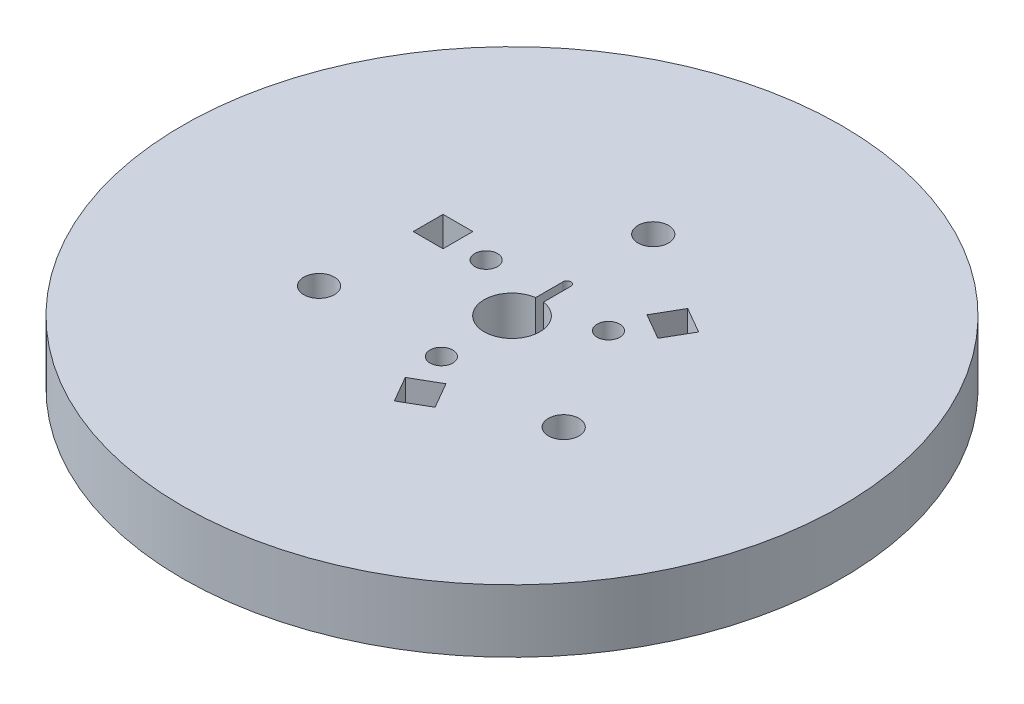
ISO-10303-21;
HEADER;
FILE_DESCRIPTION(('STEP AP214'),'2;1');
FILE_NAME('part.step','',(''),(''),'','','');
FILE_SCHEMA(('AUTOMOTIVE_DESIGN { 1 0 10303 214 1 1 1 1 }'));
ENDSEC;
DATA;
#1=APPLICATION_CONTEXT('core data for automotive mechanical design processes');
#2=APPLICATION_PROTOCOL_DEFINITION('international standard','automotive_design',2000,#1);
#3=PRODUCT_CONTEXT('',#1,'mechanical');
#4=PRODUCT('Part','Part','',(#3));
#5=PRODUCT_RELATED_PRODUCT_CATEGORY('part','',(#4));
#6=PRODUCT_DEFINITION_FORMATION('','',#4);
#7=PRODUCT_DEFINITION_CONTEXT('part definition',#1,'design');
#8=PRODUCT_DEFINITION('design','',#6,#7);
#9=PRODUCT_DEFINITION_SHAPE('','',#8);
#10=(LENGTH_UNIT() NAMED_UNIT(*) SI_UNIT(.MILLI.,.METRE.));
#11=(NAMED_UNIT(*) PLANE_ANGLE_UNIT() SI_UNIT($,.RADIAN.));
#12=(NAMED_UNIT(*) SI_UNIT($,.STERADIAN.) SOLID_ANGLE_UNIT());
#13=UNCERTAINTY_MEASURE_WITH_UNIT(LENGTH_MEASURE(1.E-05),#10,'distance_accuracy_value','');
#14=(GEOMETRIC_REPRESENTATION_CONTEXT(3) GLOBAL_UNCERTAINTY_ASSIGNED_CONTEXT((#13)) GLOBAL_UNIT_ASSIGNED_CONTEXT((#10,
#11,#12)) REPRESENTATION_CONTEXT('',''));
#15=CARTESIAN_POINT('',(0.,0.,0.));
#16=DIRECTION('',(0.,0.,1.));
#17=DIRECTION('',(1.,0.,0.));
#18=AXIS2_PLACEMENT_3D('',#15,#16,#17);
#19=CARTESIAN_POINT('',(0.,8.,0.));
#20=DIRECTION('',(0.,1.,0.));
#21=DIRECTION('',(0.,0.,1.));
#22=AXIS2_PLACEMENT_3D('',#19,#20,#21);
#23=PLANE('',#22);
#24=DIRECTION('',(0.500000000000008,0.,0.866025403784434));
#25=VECTOR('',#24,1.);
#26=CARTESIAN_POINT('',(1.90525588832576,8.,16.9));
#27=LINE('',#26,#25);
#28=CARTESIAN_POINT('',(0.00525588832573222,8.,13.6091034656191));
#29=VERTEX_POINT('',#28);
#30=CARTESIAN_POINT('',(1.90525588832576,8.,16.9));
#31=VERTEX_POINT('',#30);
#32=EDGE_CURVE('E50',#29,#31,#27,.T.);
#33=ORIENTED_EDGE('',*,*,#32,.F.);
#34=DIRECTION('',(-0.866025403784436,0.,0.500000000000004));
#35=VECTOR('',#34,1.);
#36=CARTESIAN_POINT('',(0.00525588832573222,8.,13.6091034656191));
#37=LINE('',#36,#35);
#38=CARTESIAN_POINT('',(3.29615242270659,8.,11.7091034656191));
#39=VERTEX_POINT('',#38);
#40=EDGE_CURVE('E194',#39,#29,#37,.T.);
#41=ORIENTED_EDGE('',*,*,#40,.F.);
#42=DIRECTION('',(-0.500000000000008,0.,-0.866025403784434));
#43=VECTOR('',#42,1.);
#44=CARTESIAN_POINT('',(5.19615242270662,8.,15.));
#45=LINE('',#44,#43);
#46=CARTESIAN_POINT('',(5.19615242270662,8.,15.));
#47=VERTEX_POINT('',#46);
#48=EDGE_CURVE('E191',#47,#39,#45,.T.);
#49=ORIENTED_EDGE('',*,*,#48,.F.);
#50=DIRECTION('',(0.866025403784436,0.,-0.500000000000005));
#51=VECTOR('',#50,1.);
#52=CARTESIAN_POINT('',(1.90525588832576,8.,16.9));
#53=LINE('',#52,#51);
#54=EDGE_CURVE('E187',#31,#47,#53,.T.);
#55=ORIENTED_EDGE('',*,*,#54,.F.);
#56=EDGE_LOOP('',(#33,#41,#49,#55));
#57=FACE_BOUND('',#56,.T.);
#58=DIRECTION('',(-1.,0.,0.));
#59=VECTOR('',#58,1.);
#60=CARTESIAN_POINT('',(-15.5884572681199,8.,-6.80000000000006));
#61=LINE('',#60,#59);
#62=CARTESIAN_POINT('',(-11.7884572681199,8.,-6.80000000000008));
#63=VERTEX_POINT('',#62);
#64=CARTESIAN_POINT('',(-15.5884572681199,8.,-6.80000000000006));
#65=VERTEX_POINT('',#64);
#66=EDGE_CURVE('E58',#63,#65,#61,.T.);
#67=ORIENTED_EDGE('',*,*,#66,.F.);
#68=DIRECTION('',(0.,0.,-1.));
#69=VECTOR('',#68,1.);
#70=CARTESIAN_POINT('',(-11.7884572681199,8.,-6.80000000000008));
#71=LINE('',#70,#69);
#72=CARTESIAN_POINT('',(-11.7884572681199,8.,-3.00000000000008));
#73=VERTEX_POINT('',#72);
#74=EDGE_CURVE('E214',#73,#63,#71,.T.);
#75=ORIENTED_EDGE('',*,*,#74,.F.);
#76=DIRECTION('',(1.,0.,0.));
#77=VECTOR('',#76,1.);
#78=CARTESIAN_POINT('',(-15.5884572681199,8.,-3.00000000000006));
#79=LINE('',#78,#77);
#80=CARTESIAN_POINT('',(-15.5884572681199,8.,-3.00000000000006));
#81=VERTEX_POINT('',#80);
#82=EDGE_CURVE('E211',#81,#73,#79,.T.);
#83=ORIENTED_EDGE('',*,*,#82,.F.);
#84=DIRECTION('',(0.,0.,1.));
#85=VECTOR('',#84,1.);
#86=CARTESIAN_POINT('',(-15.5884572681199,8.,-6.80000000000006));
#87=LINE('',#86,#85);
#88=EDGE_CURVE('E207',#65,#81,#87,.T.);
#89=ORIENTED_EDGE('',*,*,#88,.F.);
#90=EDGE_LOOP('',(#67,#75,#83,#89));
#91=FACE_BOUND('',#90,.T.);
#92=DIRECTION('',(0.5,0.,-0.866025403784439));
#93=VECTOR('',#92,1.);
#94=CARTESIAN_POINT('',(13.6832013797942,8.,-10.0999999999999));
#95=LINE('',#94,#93);
#96=CARTESIAN_POINT('',(11.7832013797942,8.,-6.80910346561901));
#97=VERTEX_POINT('',#96);
#98=CARTESIAN_POINT('',(13.6832013797942,8.,-10.0999999999999));
#99=VERTEX_POINT('',#98);
#100=EDGE_CURVE('E184',#97,#99,#95,.T.);
#101=ORIENTED_EDGE('',*,*,#100,.F.);
#102=DIRECTION('',(0.866025403784437,0.,0.500000000000003));
#103=VECTOR('',#102,1.);
#104=CARTESIAN_POINT('',(11.7832013797942,8.,-6.80910346561901));
#105=LINE('',#104,#103);
#106=CARTESIAN_POINT('',(8.49230484541335,8.,-8.70910346561902));
#107=VERTEX_POINT('',#106);
#108=EDGE_CURVE('E231',#107,#97,#105,.T.);
#109=ORIENTED_EDGE('',*,*,#108,.F.);
#110=DIRECTION('',(-0.5,0.,0.866025403784439));
#111=VECTOR('',#110,1.);
#112=CARTESIAN_POINT('',(10.3923048454134,8.,-11.9999999999999));
#113=LINE('',#112,#111);
#114=CARTESIAN_POINT('',(10.3923048454134,8.,-11.9999999999999));
#115=VERTEX_POINT('',#114);
#116=EDGE_CURVE('E228',#115,#107,#113,.T.);
#117=ORIENTED_EDGE('',*,*,#116,.F.);
#118=DIRECTION('',(-0.866025403784436,0.,-0.500000000000004));
#119=VECTOR('',#118,1.);
#120=CARTESIAN_POINT('',(13.6832013797942,8.,-10.0999999999999));
#121=LINE('',#120,#119);
#122=EDGE_CURVE('E225',#99,#115,#121,.T.);
#123=ORIENTED_EDGE('',*,*,#122,.F.);
#124=EDGE_LOOP('',(#101,#109,#117,#123));
#125=FACE_BOUND('',#124,.T.);
#126=DIRECTION('',(0.,0.,-1.));
#127=VECTOR('',#126,1.);
#128=CARTESIAN_POINT('',(0.499999999999999,8.,-7.));
#129=LINE('',#128,#127);
#130=CARTESIAN_POINT('',(0.499999999999999,8.,-3.51461235415799));
#131=VERTEX_POINT('',#130);
#132=CARTESIAN_POINT('',(0.499999999999999,8.,-7.));
#133=VERTEX_POINT('',#132);
#134=EDGE_CURVE('E157',#131,#133,#129,.T.);
#135=ORIENTED_EDGE('',*,*,#134,.F.);
#136=CARTESIAN_POINT('',(0.,8.,0.));
#137=DIRECTION('',(0.,1.,0.));
#138=DIRECTION('',(0.,0.,1.));
#139=AXIS2_PLACEMENT_3D('',#136,#137,#138);
#140=CIRCLE('',#139,3.55);
#141=CARTESIAN_POINT('',(-0.499999999999998,8.,-3.51461235415799));
#142=VERTEX_POINT('',#141);
#143=EDGE_CURVE('E262',#142,#131,#140,.T.);
#144=ORIENTED_EDGE('',*,*,#143,.F.);
#145=DIRECTION('',(0.,0.,1.));
#146=VECTOR('',#145,1.);
#147=CARTESIAN_POINT('',(-0.499999999999999,8.,-7.));
#148=LINE('',#147,#146);
#149=CARTESIAN_POINT('',(-0.499999999999999,8.,-7.));
#150=VERTEX_POINT('',#149);
#151=EDGE_CURVE('E243',#150,#142,#148,.T.);
#152=ORIENTED_EDGE('',*,*,#151,.F.);
#153=CARTESIAN_POINT('',(0.,8.,-7.));
#154=DIRECTION('',(0.,1.,0.));
#155=DIRECTION('',(0.,0.,1.));
#156=AXIS2_PLACEMENT_3D('',#153,#154,#155);
#157=CIRCLE('',#156,0.499999999999999);
#158=EDGE_CURVE('E200',#133,#150,#157,.T.);
#159=ORIENTED_EDGE('',*,*,#158,.F.);
#160=EDGE_LOOP('',(#135,#144,#152,#159));
#161=FACE_BOUND('',#160,.T.);
#162=CARTESIAN_POINT('',(0.,8.,9.));
#163=DIRECTION('',(0.,1.,0.));
#164=DIRECTION('',(0.,0.,1.));
#165=AXIS2_PLACEMENT_3D('',#162,#163,#164);
#166=CIRCLE('',#165,1.45);
#167=CARTESIAN_POINT('',(0.,8.,10.45));
#168=VERTEX_POINT('',#167);
#169=EDGE_CURVE('E249',#168,#168,#166,.T.);
#170=ORIENTED_EDGE('',*,*,#169,.F.);
#171=EDGE_LOOP('',(#170));
#172=FACE_BOUND('',#171,.T.);
#173=CARTESIAN_POINT('',(15.5884572681197,8.,9.00000000000029));
#174=DIRECTION('',(0.,1.,0.));
#175=DIRECTION('',(0.,0.,1.));
#176=AXIS2_PLACEMENT_3D('',#173,#174,#175);
#177=CIRCLE('',#176,1.95);
#178=CARTESIAN_POINT('',(15.5884572681197,8.,10.9500000000003));
#179=VERTEX_POINT('',#178);
#180=EDGE_CURVE('E259',#179,#179,#177,.T.);
#181=ORIENTED_EDGE('',*,*,#180,.F.);
#182=EDGE_LOOP('',(#181));
#183=FACE_BOUND('',#182,.T.);
#184=CARTESIAN_POINT('',(7.79422863405996,8.,-4.49999999999998));
#185=DIRECTION('',(0.,1.,0.));
#186=DIRECTION('',(0.,0.,1.));
#187=AXIS2_PLACEMENT_3D('',#184,#185,#186);
#188=CIRCLE('',#187,1.45);
#189=CARTESIAN_POINT('',(7.79422863405996,8.,-3.04999999999998));
#190=VERTEX_POINT('',#189);
#191=EDGE_CURVE('E267',#190,#190,#188,.T.);
#192=ORIENTED_EDGE('',*,*,#191,.F.);
#193=EDGE_LOOP('',(#192));
#194=FACE_BOUND('',#193,.T.);
#195=CARTESIAN_POINT('',(0.,8.,0.));
#196=DIRECTION('',(0.,1.,0.));
#197=DIRECTION('',(0.,0.,1.));
#198=AXIS2_PLACEMENT_3D('',#195,#196,#197);
#199=CIRCLE('',#198,42.);
#200=CARTESIAN_POINT('',(0.,8.,42.));
#201=VERTEX_POINT('',#200);
#202=EDGE_CURVE('E277',#201,#201,#199,.T.);
#203=ORIENTED_EDGE('',*,*,#202,.T.);
#204=EDGE_LOOP('',(#203));
#205=FACE_BOUND('',#204,.T.);
#206=CARTESIAN_POINT('',(0.,8.,-18.));
#207=DIRECTION('',(0.,1.,0.));
#208=DIRECTION('',(0.,0.,1.));
#209=AXIS2_PLACEMENT_3D('',#206,#207,#208);
#210=CIRCLE('',#209,1.95);
#211=CARTESIAN_POINT('',(0.,8.,-16.05));
#212=VERTEX_POINT('',#211);
#213=EDGE_CURVE('E271',#212,#212,#210,.T.);
#214=ORIENTED_EDGE('',*,*,#213,.F.);
#215=EDGE_LOOP('',(#214));
#216=FACE_BOUND('',#215,.T.);
#217=CARTESIAN_POINT('',(-15.5884572681201,8.,8.99999999999964));
#218=DIRECTION('',(0.,1.,0.));
#219=DIRECTION('',(0.,0.,1.));
#220=AXIS2_PLACEMENT_3D('',#217,#218,#219);
#221=CIRCLE('',#220,1.95);
#222=CARTESIAN_POINT('',(-15.5884572681201,8.,10.9499999999996));
#223=VERTEX_POINT('',#222);
#224=EDGE_CURVE('E253',#223,#223,#221,.T.);
#225=ORIENTED_EDGE('',*,*,#224,.F.);
#226=EDGE_LOOP('',(#225));
#227=FACE_BOUND('',#226,.T.);
#228=CARTESIAN_POINT('',(-7.79422863405989,8.,-4.50000000000009));
#229=DIRECTION('',(0.,1.,0.));
#230=DIRECTION('',(0.,0.,1.));
#231=AXIS2_PLACEMENT_3D('',#228,#229,#230);
#232=CIRCLE('',#231,1.45);
#233=CARTESIAN_POINT('',(-7.79422863405989,8.,-3.05000000000009));
#234=VERTEX_POINT('',#233);
#235=EDGE_CURVE('E161',#234,#234,#232,.T.);
#236=ORIENTED_EDGE('',*,*,#235,.F.);
#237=EDGE_LOOP('',(#236));
#238=FACE_BOUND('',#237,.T.);
#239=ADVANCED_FACE('F34',(#57,#91,#125,#161,#172,#183,#194,#205,#216,#227,#238),#23,.T.);
#240=CARTESIAN_POINT('',(0.,0.,0.));
#241=DIRECTION('',(0.,1.,0.));
#242=DIRECTION('',(0.,0.,1.));
#243=AXIS2_PLACEMENT_3D('',#240,#241,#242);
#244=PLANE('',#243);
#245=CARTESIAN_POINT('',(0.,0.,0.));
#246=DIRECTION('',(0.,-1.,0.));
#247=DIRECTION('',(0.,0.,-1.));
#248=AXIS2_PLACEMENT_3D('',#245,#246,#247);
#249=CIRCLE('',#248,12.);
#250=CARTESIAN_POINT('',(0.,0.,-12.));
#251=VERTEX_POINT('',#250);
#252=EDGE_CURVE('E11',#251,#251,#249,.T.);
#253=ORIENTED_EDGE('',*,*,#252,.F.);
#254=EDGE_LOOP('',(#253));
#255=FACE_BOUND('',#254,.T.);
#256=DIRECTION('',(-0.866025403784436,0.,0.500000000000004));
#257=VECTOR('',#256,1.);
#258=CARTESIAN_POINT('',(5.89422863405998,0.,10.2091034656191));
#259=LINE('',#258,#257);
#260=CARTESIAN_POINT('',(3.29615242270659,0.,11.7091034656191));
#261=VERTEX_POINT('',#260);
#262=CARTESIAN_POINT('',(0.00525588832573222,0.,13.6091034656191));
#263=VERTEX_POINT('',#262);
#264=EDGE_CURVE('E315',#261,#263,#259,.T.);
#265=ORIENTED_EDGE('',*,*,#264,.T.);
#266=DIRECTION('',(0.500000000000008,0.,0.866025403784434));
#267=VECTOR('',#266,1.);
#268=CARTESIAN_POINT('',(-5.88897274573427,0.,3.40000000000012));
#269=LINE('',#268,#267);
#270=CARTESIAN_POINT('',(1.90525588832576,0.,16.9));
#271=VERTEX_POINT('',#270);
#272=EDGE_CURVE('E38',#263,#271,#269,.T.);
#273=ORIENTED_EDGE('',*,*,#272,.T.);
#274=DIRECTION('',(0.866025403784436,0.,-0.500000000000005));
#275=VECTOR('',#274,1.);
#276=CARTESIAN_POINT('',(7.79422863406001,0.,13.4999999999999));
#277=LINE('',#276,#275);
#278=CARTESIAN_POINT('',(5.19615242270662,0.,15.));
#279=VERTEX_POINT('',#278);
#280=EDGE_CURVE('E310',#271,#279,#277,.T.);
#281=ORIENTED_EDGE('',*,*,#280,.T.);
#282=DIRECTION('',(-0.500000000000008,0.,-0.866025403784434));
#283=VECTOR('',#282,1.);
#284=CARTESIAN_POINT('',(-2.59807621135342,0.,1.50000000000009));
#285=LINE('',#284,#283);
#286=EDGE_CURVE('E313',#279,#261,#285,.T.);
#287=ORIENTED_EDGE('',*,*,#286,.T.);
#288=EDGE_LOOP('',(#265,#273,#281,#287));
#289=FACE_BOUND('',#288,.T.);
#290=DIRECTION('',(0.,0.,-1.));
#291=VECTOR('',#290,1.);
#292=CARTESIAN_POINT('',(-11.7884572681198,0.,0.));
#293=LINE('',#292,#291);
#294=CARTESIAN_POINT('',(-11.7884572681199,0.,-3.00000000000008));
#295=VERTEX_POINT('',#294);
#296=CARTESIAN_POINT('',(-11.7884572681199,0.,-6.80000000000008));
#297=VERTEX_POINT('',#296);
#298=EDGE_CURVE('E304',#295,#297,#293,.T.);
#299=ORIENTED_EDGE('',*,*,#298,.T.);
#300=DIRECTION('',(-1.,0.,0.));
#301=VECTOR('',#300,1.);
#302=CARTESIAN_POINT('',(0.,0.,-6.80000000000013));
#303=LINE('',#302,#301);
#304=CARTESIAN_POINT('',(-15.5884572681199,0.,-6.80000000000006));
#305=VERTEX_POINT('',#304);
#306=EDGE_CURVE('E307',#297,#305,#303,.T.);
#307=ORIENTED_EDGE('',*,*,#306,.T.);
#308=DIRECTION('',(0.,0.,1.));
#309=VECTOR('',#308,1.);
#310=CARTESIAN_POINT('',(-15.5884572681199,0.,0.));
#311=LINE('',#310,#309);
#312=CARTESIAN_POINT('',(-15.5884572681199,0.,-3.00000000000006));
#313=VERTEX_POINT('',#312);
#314=EDGE_CURVE('E298',#305,#313,#311,.T.);
#315=ORIENTED_EDGE('',*,*,#314,.T.);
#316=DIRECTION('',(1.,0.,0.));
#317=VECTOR('',#316,1.);
#318=CARTESIAN_POINT('',(0.,0.,-3.00000000000013));
#319=LINE('',#318,#317);
#320=EDGE_CURVE('E301',#313,#295,#319,.T.);
#321=ORIENTED_EDGE('',*,*,#320,.T.);
#322=EDGE_LOOP('',(#299,#307,#315,#321));
#323=FACE_BOUND('',#322,.T.);
#324=DIRECTION('',(0.866025403784437,0.,0.500000000000003));
#325=VECTOR('',#324,1.);
#326=CARTESIAN_POINT('',(5.89422863405996,0.,-10.2091034656191));
#327=LINE('',#326,#325);
#328=CARTESIAN_POINT('',(8.49230484541335,0.,-8.70910346561902));
#329=VERTEX_POINT('',#328);
#330=CARTESIAN_POINT('',(11.7832013797942,0.,-6.80910346561901));
#331=VERTEX_POINT('',#330);
#332=EDGE_CURVE('E292',#329,#331,#327,.T.);
#333=ORIENTED_EDGE('',*,*,#332,.T.);
#334=DIRECTION('',(0.5,0.,-0.866025403784439));
#335=VECTOR('',#334,1.);
#336=CARTESIAN_POINT('',(5.88897274573429,0.,3.40000000000007));
#337=LINE('',#336,#335);
#338=CARTESIAN_POINT('',(13.6832013797942,0.,-10.0999999999999));
#339=VERTEX_POINT('',#338);
#340=EDGE_CURVE('E295',#331,#339,#337,.T.);
#341=ORIENTED_EDGE('',*,*,#340,.T.);
#342=DIRECTION('',(-0.866025403784436,0.,-0.500000000000004));
#343=VECTOR('',#342,1.);
#344=CARTESIAN_POINT('',(7.79422863406,0.,-13.4999999999999));
#345=LINE('',#344,#343);
#346=CARTESIAN_POINT('',(10.3923048454134,0.,-11.9999999999999));
#347=VERTEX_POINT('',#346);
#348=EDGE_CURVE('E286',#339,#347,#345,.T.);
#349=ORIENTED_EDGE('',*,*,#348,.T.);
#350=DIRECTION('',(-0.5,0.,0.866025403784439));
#351=VECTOR('',#350,1.);
#352=CARTESIAN_POINT('',(2.59807621135343,0.,1.50000000000006));
#353=LINE('',#352,#351);
#354=EDGE_CURVE('E289',#347,#329,#353,.T.);
#355=ORIENTED_EDGE('',*,*,#354,.T.);
#356=EDGE_LOOP('',(#333,#341,#349,#355));
#357=FACE_BOUND('',#356,.T.);
#358=CARTESIAN_POINT('',(0.,0.,0.));
#359=DIRECTION('',(0.,1.,0.));
#360=DIRECTION('',(0.,0.,1.));
#361=AXIS2_PLACEMENT_3D('',#358,#359,#360);
#362=CIRCLE('',#361,42.);
#363=CARTESIAN_POINT('',(0.,0.,42.));
#364=VERTEX_POINT('',#363);
#365=EDGE_CURVE('E274',#364,#364,#362,.T.);
#366=ORIENTED_EDGE('',*,*,#365,.F.);
#367=EDGE_LOOP('',(#366));
#368=FACE_BOUND('',#367,.T.);
#369=CARTESIAN_POINT('',(0.,0.,-18.));
#370=DIRECTION('',(0.,1.,0.));
#371=DIRECTION('',(0.,0.,1.));
#372=AXIS2_PLACEMENT_3D('',#369,#370,#371);
#373=CIRCLE('',#372,1.95);
#374=CARTESIAN_POINT('',(0.,0.,-16.05));
#375=VERTEX_POINT('',#374);
#376=EDGE_CURVE('E270',#375,#375,#373,.T.);
#377=ORIENTED_EDGE('',*,*,#376,.T.);
#378=EDGE_LOOP('',(#377));
#379=FACE_BOUND('',#378,.T.);
#380=CARTESIAN_POINT('',(15.5884572681197,0.,9.00000000000029));
#381=DIRECTION('',(0.,1.,0.));
#382=DIRECTION('',(0.,0.,1.));
#383=AXIS2_PLACEMENT_3D('',#380,#381,#382);
#384=CIRCLE('',#383,1.95);
#385=CARTESIAN_POINT('',(15.5884572681197,0.,10.9500000000003));
#386=VERTEX_POINT('',#385);
#387=EDGE_CURVE('E256',#386,#386,#384,.T.);
#388=ORIENTED_EDGE('',*,*,#387,.T.);
#389=EDGE_LOOP('',(#388));
#390=FACE_BOUND('',#389,.T.);
#391=CARTESIAN_POINT('',(-15.5884572681201,0.,8.99999999999964));
#392=DIRECTION('',(0.,1.,0.));
#393=DIRECTION('',(0.,0.,1.));
#394=AXIS2_PLACEMENT_3D('',#391,#392,#393);
#395=CIRCLE('',#394,1.95);
#396=CARTESIAN_POINT('',(-15.5884572681201,0.,10.9499999999996));
#397=VERTEX_POINT('',#396);
#398=EDGE_CURVE('E252',#397,#397,#395,.T.);
#399=ORIENTED_EDGE('',*,*,#398,.T.);
#400=EDGE_LOOP('',(#399));
#401=FACE_BOUND('',#400,.T.);
#402=ADVANCED_FACE('F319',(#255,#289,#323,#357,#368,#379,#390,#401),#244,.F.);
#403=CARTESIAN_POINT('',(0.,8.,0.));
#404=DIRECTION('',(0.,-1.,0.));
#405=DIRECTION('',(0.,0.,-1.));
#406=AXIS2_PLACEMENT_3D('',#403,#404,#405);
#407=CYLINDRICAL_SURFACE('',#406,42.);
#408=ORIENTED_EDGE('',*,*,#202,.F.);
#409=EDGE_LOOP('',(#408));
#410=FACE_BOUND('',#409,.T.);
#411=ORIENTED_EDGE('',*,*,#365,.T.);
#412=EDGE_LOOP('',(#411));
#413=FACE_BOUND('',#412,.T.);
#414=ADVANCED_FACE('F36',(#410,#413),#407,.T.);
#415=CARTESIAN_POINT('',(0.,8.,-18.));
#416=DIRECTION('',(0.,-1.,0.));
#417=DIRECTION('',(0.,0.,-1.));
#418=AXIS2_PLACEMENT_3D('',#415,#416,#417);
#419=CYLINDRICAL_SURFACE('',#418,1.95);
#420=ORIENTED_EDGE('',*,*,#213,.T.);
#421=EDGE_LOOP('',(#420));
#422=FACE_BOUND('',#421,.T.);
#423=ORIENTED_EDGE('',*,*,#376,.F.);
#424=EDGE_LOOP('',(#423));
#425=FACE_BOUND('',#424,.T.);
#426=ADVANCED_FACE('F351',(#422,#425),#419,.F.);
#427=CARTESIAN_POINT('',(7.79422863405996,8.,-4.49999999999998));
#428=DIRECTION('',(0.,-1.,0.));
#429=DIRECTION('',(0.,0.,-1.));
#430=AXIS2_PLACEMENT_3D('',#427,#428,#429);
#431=CYLINDRICAL_SURFACE('',#430,1.45);
#432=ORIENTED_EDGE('',*,*,#191,.T.);
#433=EDGE_LOOP('',(#432));
#434=FACE_BOUND('',#433,.T.);
#435=CARTESIAN_POINT('',(7.79422863405996,-3.,-4.49999999999998));
#436=DIRECTION('',(0.,-1.,0.));
#437=DIRECTION('',(0.,0.,-1.));
#438=AXIS2_PLACEMENT_3D('',#435,#436,#437);
#439=CIRCLE('',#438,1.45);
#440=CARTESIAN_POINT('',(7.79422863405996,-3.,-5.94999999999998));
#441=VERTEX_POINT('',#440);
#442=EDGE_CURVE('E527',#441,#441,#439,.T.);
#443=ORIENTED_EDGE('',*,*,#442,.T.);
#444=EDGE_LOOP('',(#443));
#445=FACE_BOUND('',#444,.T.);
#446=ADVANCED_FACE('F354',(#434,#445),#431,.F.);
#447=CARTESIAN_POINT('',(0.,8.,0.));
#448=DIRECTION('',(0.,-1.,0.));
#449=DIRECTION('',(0.,0.,-1.));
#450=AXIS2_PLACEMENT_3D('',#447,#448,#449);
#451=CYLINDRICAL_SURFACE('',#450,3.55);
#452=DIRECTION('',(0.,-1.,0.));
#453=VECTOR('',#452,1.);
#454=CARTESIAN_POINT('',(0.499999999999999,8.,-3.51461235415799));
#455=LINE('',#454,#453);
#456=CARTESIAN_POINT('',(0.499999999999999,-3.,-3.51461235415799));
#457=VERTEX_POINT('',#456);
#458=EDGE_CURVE('E284',#457,#131,#455,.F.);
#459=ORIENTED_EDGE('',*,*,#458,.F.);
#460=CARTESIAN_POINT('',(0.,-3.,0.));
#461=DIRECTION('',(0.,-1.,0.));
#462=DIRECTION('',(0.,0.,-1.));
#463=AXIS2_PLACEMENT_3D('',#460,#461,#462);
#464=CIRCLE('',#463,3.55);
#465=CARTESIAN_POINT('',(-0.499999999999998,-3.,-3.51461235415799));
#466=VERTEX_POINT('',#465);
#467=EDGE_CURVE('E175',#457,#466,#464,.T.);
#468=ORIENTED_EDGE('',*,*,#467,.T.);
#469=DIRECTION('',(0.,-1.,0.));
#470=VECTOR('',#469,1.);
#471=CARTESIAN_POINT('',(-0.499999999999998,8.,-3.51461235415799));
#472=LINE('',#471,#470);
#473=EDGE_CURVE('E280',#142,#466,#472,.T.);
#474=ORIENTED_EDGE('',*,*,#473,.F.);
#475=ORIENTED_EDGE('',*,*,#143,.T.);
#476=EDGE_LOOP('',(#459,#468,#474,#475));
#477=FACE_BOUND('',#476,.T.);
#478=ADVANCED_FACE('F358',(#477),#451,.F.);
#479=CARTESIAN_POINT('',(15.5884572681197,8.,9.00000000000029));
#480=DIRECTION('',(0.,-1.,0.));
#481=DIRECTION('',(0.,0.,-1.));
#482=AXIS2_PLACEMENT_3D('',#479,#480,#481);
#483=CYLINDRICAL_SURFACE('',#482,1.95);
#484=ORIENTED_EDGE('',*,*,#180,.T.);
#485=EDGE_LOOP('',(#484));
#486=FACE_BOUND('',#485,.T.);
#487=ORIENTED_EDGE('',*,*,#387,.F.);
#488=EDGE_LOOP('',(#487));
#489=FACE_BOUND('',#488,.T.);
#490=ADVANCED_FACE('F362',(#486,#489),#483,.F.);
#491=CARTESIAN_POINT('',(-15.5884572681201,8.,8.99999999999964));
#492=DIRECTION('',(0.,-1.,0.));
#493=DIRECTION('',(0.,0.,-1.));
#494=AXIS2_PLACEMENT_3D('',#491,#492,#493);
#495=CYLINDRICAL_SURFACE('',#494,1.95);
#496=ORIENTED_EDGE('',*,*,#224,.T.);
#497=EDGE_LOOP('',(#496));
#498=FACE_BOUND('',#497,.T.);
#499=ORIENTED_EDGE('',*,*,#398,.F.);
#500=EDGE_LOOP('',(#499));
#501=FACE_BOUND('',#500,.T.);
#502=ADVANCED_FACE('F366',(#498,#501),#495,.F.);
#503=CARTESIAN_POINT('',(0.,8.,9.));
#504=DIRECTION('',(0.,-1.,0.));
#505=DIRECTION('',(0.,0.,-1.));
#506=AXIS2_PLACEMENT_3D('',#503,#504,#505);
#507=CYLINDRICAL_SURFACE('',#506,1.45);
#508=ORIENTED_EDGE('',*,*,#169,.T.);
#509=EDGE_LOOP('',(#508));
#510=FACE_BOUND('',#509,.T.);
#511=CARTESIAN_POINT('',(0.,-3.,9.));
#512=DIRECTION('',(0.,-1.,0.));
#513=DIRECTION('',(0.,0.,-1.));
#514=AXIS2_PLACEMENT_3D('',#511,#512,#513);
#515=CIRCLE('',#514,1.45);
#516=CARTESIAN_POINT('',(0.,-3.,7.55));
#517=VERTEX_POINT('',#516);
#518=EDGE_CURVE('E170',#517,#517,#515,.T.);
#519=ORIENTED_EDGE('',*,*,#518,.T.);
#520=EDGE_LOOP('',(#519));
#521=FACE_BOUND('',#520,.T.);
#522=ADVANCED_FACE('F370',(#510,#521),#507,.F.);
#523=CARTESIAN_POINT('',(-7.79422863405989,8.,-4.50000000000009));
#524=DIRECTION('',(0.,-1.,0.));
#525=DIRECTION('',(0.,0.,-1.));
#526=AXIS2_PLACEMENT_3D('',#523,#524,#525);
#527=CYLINDRICAL_SURFACE('',#526,1.45);
#528=ORIENTED_EDGE('',*,*,#235,.T.);
#529=EDGE_LOOP('',(#528));
#530=FACE_BOUND('',#529,.T.);
#531=CARTESIAN_POINT('',(-7.79422863405989,-3.,-4.50000000000009));
#532=DIRECTION('',(0.,-1.,0.));
#533=DIRECTION('',(0.,0.,-1.));
#534=AXIS2_PLACEMENT_3D('',#531,#532,#533);
#535=CIRCLE('',#534,1.45);
#536=CARTESIAN_POINT('',(-7.79422863405989,-3.,-5.95000000000009));
#537=VERTEX_POINT('',#536);
#538=EDGE_CURVE('E529',#537,#537,#535,.T.);
#539=ORIENTED_EDGE('',*,*,#538,.T.);
#540=EDGE_LOOP('',(#539));
#541=FACE_BOUND('',#540,.T.);
#542=ADVANCED_FACE('F374',(#530,#541),#527,.F.);
#543=CARTESIAN_POINT('',(0.,-2.,-7.));
#544=DIRECTION('',(0.,1.,0.));
#545=DIRECTION('',(0.,0.,1.));
#546=AXIS2_PLACEMENT_3D('',#543,#544,#545);
#547=CYLINDRICAL_SURFACE('',#546,0.499999999999999);
#548=DIRECTION('',(0.,1.,0.));
#549=VECTOR('',#548,1.);
#550=CARTESIAN_POINT('',(0.499999999999999,-2.,-7.));
#551=LINE('',#550,#549);
#552=CARTESIAN_POINT('',(0.499999999999999,-3.,-7.));
#553=VERTEX_POINT('',#552);
#554=EDGE_CURVE('E150',#553,#133,#551,.T.);
#555=ORIENTED_EDGE('',*,*,#554,.T.);
#556=ORIENTED_EDGE('',*,*,#158,.T.);
#557=DIRECTION('',(0.,1.,0.));
#558=VECTOR('',#557,1.);
#559=CARTESIAN_POINT('',(-0.499999999999999,-2.,-7.));
#560=LINE('',#559,#558);
#561=CARTESIAN_POINT('',(-0.499999999999999,-3.,-7.));
#562=VERTEX_POINT('',#561);
#563=EDGE_CURVE('E162',#562,#150,#560,.T.);
#564=ORIENTED_EDGE('',*,*,#563,.F.);
#565=CARTESIAN_POINT('',(0.,-3.,-7.));
#566=DIRECTION('',(0.,-1.,0.));
#567=DIRECTION('',(0.,0.,-1.));
#568=AXIS2_PLACEMENT_3D('',#565,#566,#567);
#569=CIRCLE('',#568,0.499999999999999);
#570=EDGE_CURVE('E165',#562,#553,#569,.T.);
#571=ORIENTED_EDGE('',*,*,#570,.T.);
#572=EDGE_LOOP('',(#555,#556,#564,#571));
#573=FACE_BOUND('',#572,.T.);
#574=ADVANCED_FACE('F166',(#573),#547,.F.);
#575=CARTESIAN_POINT('',(0.499999999999999,-2.,-7.));
#576=DIRECTION('',(1.,0.,0.));
#577=DIRECTION('',(0.,0.,-1.));
#578=AXIS2_PLACEMENT_3D('',#575,#576,#577);
#579=PLANE('',#578);
#580=ORIENTED_EDGE('',*,*,#458,.T.);
#581=ORIENTED_EDGE('',*,*,#134,.T.);
#582=ORIENTED_EDGE('',*,*,#554,.F.);
#583=DIRECTION('',(0.,0.,1.));
#584=VECTOR('',#583,1.);
#585=CARTESIAN_POINT('',(0.499999999999999,-3.,-3.51461235415799));
#586=LINE('',#585,#584);
#587=EDGE_CURVE('E154',#553,#457,#586,.T.);
#588=ORIENTED_EDGE('',*,*,#587,.T.);
#589=EDGE_LOOP('',(#580,#581,#582,#588));
#590=FACE_BOUND('',#589,.T.);
#591=ADVANCED_FACE('F152',(#590),#579,.F.);
#592=CARTESIAN_POINT('',(-0.499999999999999,-2.,-7.));
#593=DIRECTION('',(-1.,0.,0.));
#594=DIRECTION('',(0.,0.,1.));
#595=AXIS2_PLACEMENT_3D('',#592,#593,#594);
#596=PLANE('',#595);
#597=ORIENTED_EDGE('',*,*,#563,.T.);
#598=ORIENTED_EDGE('',*,*,#151,.T.);
#599=ORIENTED_EDGE('',*,*,#473,.T.);
#600=DIRECTION('',(0.,0.,-1.));
#601=VECTOR('',#600,1.);
#602=CARTESIAN_POINT('',(-0.499999999999999,-3.,-7.));
#603=LINE('',#602,#601);
#604=EDGE_CURVE('E177',#466,#562,#603,.T.);
#605=ORIENTED_EDGE('',*,*,#604,.T.);
#606=EDGE_LOOP('',(#597,#598,#599,#605));
#607=FACE_BOUND('',#606,.T.);
#608=ADVANCED_FACE('F381',(#607),#596,.F.);
#609=CARTESIAN_POINT('',(13.6832013797942,-27.,-10.0999999999999));
#610=DIRECTION('',(0.866025403784439,0.,0.5));
#611=DIRECTION('',(0.5,0.,-0.866025403784439));
#612=AXIS2_PLACEMENT_3D('',#609,#610,#611);
#613=PLANE('',#612);
#614=DIRECTION('',(0.,1.,0.));
#615=VECTOR('',#614,1.);
#616=CARTESIAN_POINT('',(11.7832013797942,-27.,-6.80910346561901));
#617=LINE('',#616,#615);
#618=EDGE_CURVE('E208',#331,#97,#617,.T.);
#619=ORIENTED_EDGE('',*,*,#618,.T.);
#620=ORIENTED_EDGE('',*,*,#100,.T.);
#621=DIRECTION('',(0.,1.,0.));
#622=VECTOR('',#621,1.);
#623=CARTESIAN_POINT('',(13.6832013797942,-27.,-10.0999999999999));
#624=LINE('',#623,#622);
#625=EDGE_CURVE('E234',#339,#99,#624,.T.);
#626=ORIENTED_EDGE('',*,*,#625,.F.);
#627=ORIENTED_EDGE('',*,*,#340,.F.);
#628=EDGE_LOOP('',(#619,#620,#626,#627));
#629=FACE_BOUND('',#628,.T.);
#630=ADVANCED_FACE('F384',(#629),#613,.F.);
#631=CARTESIAN_POINT('',(11.7832013797942,-27.,-6.80910346561901));
#632=DIRECTION('',(-0.500000000000003,0.,0.866025403784437));
#633=DIRECTION('',(0.866025403784437,0.,0.500000000000003));
#634=AXIS2_PLACEMENT_3D('',#631,#632,#633);
#635=PLANE('',#634);
#636=DIRECTION('',(0.,1.,0.));
#637=VECTOR('',#636,1.);
#638=CARTESIAN_POINT('',(8.49230484541335,-27.,-8.70910346561902));
#639=LINE('',#638,#637);
#640=EDGE_CURVE('E236',#329,#107,#639,.T.);
#641=ORIENTED_EDGE('',*,*,#640,.T.);
#642=ORIENTED_EDGE('',*,*,#108,.T.);
#643=ORIENTED_EDGE('',*,*,#618,.F.);
#644=ORIENTED_EDGE('',*,*,#332,.F.);
#645=EDGE_LOOP('',(#641,#642,#643,#644));
#646=FACE_BOUND('',#645,.T.);
#647=ADVANCED_FACE('F390',(#646),#635,.F.);
#648=CARTESIAN_POINT('',(10.3923048454134,-27.,-11.9999999999999));
#649=DIRECTION('',(-0.866025403784439,0.,-0.5));
#650=DIRECTION('',(-0.5,0.,0.866025403784439));
#651=AXIS2_PLACEMENT_3D('',#648,#649,#650);
#652=PLANE('',#651);
#653=DIRECTION('',(0.,1.,0.));
#654=VECTOR('',#653,1.);
#655=CARTESIAN_POINT('',(10.3923048454134,-27.,-11.9999999999999));
#656=LINE('',#655,#654);
#657=EDGE_CURVE('E238',#347,#115,#656,.T.);
#658=ORIENTED_EDGE('',*,*,#657,.T.);
#659=ORIENTED_EDGE('',*,*,#116,.T.);
#660=ORIENTED_EDGE('',*,*,#640,.F.);
#661=ORIENTED_EDGE('',*,*,#354,.F.);
#662=EDGE_LOOP('',(#658,#659,#660,#661));
#663=FACE_BOUND('',#662,.T.);
#664=ADVANCED_FACE('F396',(#663),#652,.F.);
#665=CARTESIAN_POINT('',(13.6832013797942,-27.,-10.0999999999999));
#666=DIRECTION('',(0.500000000000004,0.,-0.866025403784436));
#667=DIRECTION('',(-0.866025403784436,0.,-0.500000000000004));
#668=AXIS2_PLACEMENT_3D('',#665,#666,#667);
#669=PLANE('',#668);
#670=ORIENTED_EDGE('',*,*,#625,.T.);
#671=ORIENTED_EDGE('',*,*,#122,.T.);
#672=ORIENTED_EDGE('',*,*,#657,.F.);
#673=ORIENTED_EDGE('',*,*,#348,.F.);
#674=EDGE_LOOP('',(#670,#671,#672,#673));
#675=FACE_BOUND('',#674,.T.);
#676=ADVANCED_FACE('F392',(#675),#669,.F.);
#677=CARTESIAN_POINT('',(-15.5884572681199,-27.,-6.80000000000006));
#678=DIRECTION('',(0.,0.,-1.));
#679=DIRECTION('',(-1.,0.,0.));
#680=AXIS2_PLACEMENT_3D('',#677,#678,#679);
#681=PLANE('',#680);
#682=DIRECTION('',(0.,1.,0.));
#683=VECTOR('',#682,1.);
#684=CARTESIAN_POINT('',(-11.7884572681199,-27.,-6.80000000000008));
#685=LINE('',#684,#683);
#686=EDGE_CURVE('E188',#297,#63,#685,.T.);
#687=ORIENTED_EDGE('',*,*,#686,.T.);
#688=ORIENTED_EDGE('',*,*,#66,.T.);
#689=DIRECTION('',(0.,1.,0.));
#690=VECTOR('',#689,1.);
#691=CARTESIAN_POINT('',(-15.5884572681199,-27.,-6.80000000000006));
#692=LINE('',#691,#690);
#693=EDGE_CURVE('E217',#305,#65,#692,.T.);
#694=ORIENTED_EDGE('',*,*,#693,.F.);
#695=ORIENTED_EDGE('',*,*,#306,.F.);
#696=EDGE_LOOP('',(#687,#688,#694,#695));
#697=FACE_BOUND('',#696,.T.);
#698=ADVANCED_FACE('F395',(#697),#681,.F.);
#699=CARTESIAN_POINT('',(-11.7884572681199,-27.,-6.80000000000008));
#700=DIRECTION('',(1.,0.,0.));
#701=DIRECTION('',(0.,0.,-1.));
#702=AXIS2_PLACEMENT_3D('',#699,#700,#701);
#703=PLANE('',#702);
#704=DIRECTION('',(0.,1.,0.));
#705=VECTOR('',#704,1.);
#706=CARTESIAN_POINT('',(-11.7884572681199,-27.,-3.00000000000008));
#707=LINE('',#706,#705);
#708=EDGE_CURVE('E219',#295,#73,#707,.T.);
#709=ORIENTED_EDGE('',*,*,#708,.T.);
#710=ORIENTED_EDGE('',*,*,#74,.T.);
#711=ORIENTED_EDGE('',*,*,#686,.F.);
#712=ORIENTED_EDGE('',*,*,#298,.F.);
#713=EDGE_LOOP('',(#709,#710,#711,#712));
#714=FACE_BOUND('',#713,.T.);
#715=ADVANCED_FACE('F406',(#714),#703,.F.);
#716=CARTESIAN_POINT('',(-15.5884572681199,-27.,-3.00000000000006));
#717=DIRECTION('',(0.,0.,1.));
#718=DIRECTION('',(1.,0.,0.));
#719=AXIS2_PLACEMENT_3D('',#716,#717,#718);
#720=PLANE('',#719);
#721=DIRECTION('',(0.,1.,0.));
#722=VECTOR('',#721,1.);
#723=CARTESIAN_POINT('',(-15.5884572681199,-27.,-3.00000000000006));
#724=LINE('',#723,#722);
#725=EDGE_CURVE('E221',#313,#81,#724,.T.);
#726=ORIENTED_EDGE('',*,*,#725,.T.);
#727=ORIENTED_EDGE('',*,*,#82,.T.);
#728=ORIENTED_EDGE('',*,*,#708,.F.);
#729=ORIENTED_EDGE('',*,*,#320,.F.);
#730=EDGE_LOOP('',(#726,#727,#728,#729));
#731=FACE_BOUND('',#730,.T.);
#732=ADVANCED_FACE('F410',(#731),#720,.F.);
#733=CARTESIAN_POINT('',(-15.5884572681199,-27.,-6.80000000000006));
#734=DIRECTION('',(-1.,0.,0.));
#735=DIRECTION('',(0.,0.,1.));
#736=AXIS2_PLACEMENT_3D('',#733,#734,#735);
#737=PLANE('',#736);
#738=ORIENTED_EDGE('',*,*,#693,.T.);
#739=ORIENTED_EDGE('',*,*,#88,.T.);
#740=ORIENTED_EDGE('',*,*,#725,.F.);
#741=ORIENTED_EDGE('',*,*,#314,.F.);
#742=EDGE_LOOP('',(#738,#739,#740,#741));
#743=FACE_BOUND('',#742,.T.);
#744=ADVANCED_FACE('F407',(#743),#737,.F.);
#745=CARTESIAN_POINT('',(1.90525588832576,-27.,16.9));
#746=DIRECTION('',(-0.866025403784434,0.,0.500000000000008));
#747=DIRECTION('',(0.500000000000008,0.,0.866025403784434));
#748=AXIS2_PLACEMENT_3D('',#745,#746,#747);
#749=PLANE('',#748);
#750=DIRECTION('',(0.,1.,0.));
#751=VECTOR('',#750,1.);
#752=CARTESIAN_POINT('',(0.00525588832573222,-27.,13.6091034656191));
#753=LINE('',#752,#751);
#754=EDGE_CURVE('E198',#263,#29,#753,.T.);
#755=ORIENTED_EDGE('',*,*,#754,.T.);
#756=ORIENTED_EDGE('',*,*,#32,.T.);
#757=DIRECTION('',(0.,1.,0.));
#758=VECTOR('',#757,1.);
#759=CARTESIAN_POINT('',(1.90525588832576,-27.,16.9));
#760=LINE('',#759,#758);
#761=EDGE_CURVE('E197',#271,#31,#760,.T.);
#762=ORIENTED_EDGE('',*,*,#761,.F.);
#763=ORIENTED_EDGE('',*,*,#272,.F.);
#764=EDGE_LOOP('',(#755,#756,#762,#763));
#765=FACE_BOUND('',#764,.T.);
#766=ADVANCED_FACE('F322',(#765),#749,.F.);
#767=CARTESIAN_POINT('',(0.00525588832573222,-27.,13.6091034656191));
#768=DIRECTION('',(-0.500000000000004,0.,-0.866025403784436));
#769=DIRECTION('',(-0.866025403784436,0.,0.500000000000004));
#770=AXIS2_PLACEMENT_3D('',#767,#768,#769);
#771=PLANE('',#770);
#772=DIRECTION('',(0.,1.,0.));
#773=VECTOR('',#772,1.);
#774=CARTESIAN_POINT('',(3.29615242270659,-27.,11.7091034656191));
#775=LINE('',#774,#773);
#776=EDGE_CURVE('E201',#261,#39,#775,.T.);
#777=ORIENTED_EDGE('',*,*,#776,.T.);
#778=ORIENTED_EDGE('',*,*,#40,.T.);
#779=ORIENTED_EDGE('',*,*,#754,.F.);
#780=ORIENTED_EDGE('',*,*,#264,.F.);
#781=EDGE_LOOP('',(#777,#778,#779,#780));
#782=FACE_BOUND('',#781,.T.);
#783=ADVANCED_FACE('F324',(#782),#771,.F.);
#784=CARTESIAN_POINT('',(5.19615242270662,-27.,15.));
#785=DIRECTION('',(0.866025403784434,0.,-0.500000000000008));
#786=DIRECTION('',(-0.500000000000008,0.,-0.866025403784434));
#787=AXIS2_PLACEMENT_3D('',#784,#785,#786);
#788=PLANE('',#787);
#789=DIRECTION('',(0.,1.,0.));
#790=VECTOR('',#789,1.);
#791=CARTESIAN_POINT('',(5.19615242270662,-27.,15.));
#792=LINE('',#791,#790);
#793=EDGE_CURVE('E203',#279,#47,#792,.T.);
#794=ORIENTED_EDGE('',*,*,#793,.T.);
#795=ORIENTED_EDGE('',*,*,#48,.T.);
#796=ORIENTED_EDGE('',*,*,#776,.F.);
#797=ORIENTED_EDGE('',*,*,#286,.F.);
#798=EDGE_LOOP('',(#794,#795,#796,#797));
#799=FACE_BOUND('',#798,.T.);
#800=ADVANCED_FACE('F335',(#799),#788,.F.);
#801=CARTESIAN_POINT('',(1.90525588832576,-27.,16.9));
#802=DIRECTION('',(0.500000000000005,0.,0.866025403784436));
#803=DIRECTION('',(0.866025403784436,0.,-0.500000000000005));
#804=AXIS2_PLACEMENT_3D('',#801,#802,#803);
#805=PLANE('',#804);
#806=ORIENTED_EDGE('',*,*,#761,.T.);
#807=ORIENTED_EDGE('',*,*,#54,.T.);
#808=ORIENTED_EDGE('',*,*,#793,.F.);
#809=ORIENTED_EDGE('',*,*,#280,.F.);
#810=EDGE_LOOP('',(#806,#807,#808,#809));
#811=FACE_BOUND('',#810,.T.);
#812=ADVANCED_FACE('F332',(#811),#805,.F.);
#813=CARTESIAN_POINT('',(0.,-3.,0.));
#814=DIRECTION('',(0.,-1.,0.));
#815=DIRECTION('',(0.,0.,-1.));
#816=AXIS2_PLACEMENT_3D('',#813,#814,#815);
#817=PLANE('',#816);
#818=ORIENTED_EDGE('',*,*,#538,.F.);
#819=EDGE_LOOP('',(#818));
#820=FACE_BOUND('',#819,.T.);
#821=ORIENTED_EDGE('',*,*,#587,.F.);
#822=ORIENTED_EDGE('',*,*,#570,.F.);
#823=ORIENTED_EDGE('',*,*,#604,.F.);
#824=ORIENTED_EDGE('',*,*,#467,.F.);
#825=EDGE_LOOP('',(#821,#822,#823,#824));
#826=FACE_BOUND('',#825,.T.);
#827=CARTESIAN_POINT('',(0.,-3.,0.));
#828=DIRECTION('',(0.,-1.,0.));
#829=DIRECTION('',(0.,0.,-1.));
#830=AXIS2_PLACEMENT_3D('',#827,#828,#829);
#831=CIRCLE('',#830,12.);
#832=CARTESIAN_POINT('',(0.,-3.,-12.));
#833=VERTEX_POINT('',#832);
#834=EDGE_CURVE('E182',#833,#833,#831,.T.);
#835=ORIENTED_EDGE('',*,*,#834,.T.);
#836=EDGE_LOOP('',(#835));
#837=FACE_BOUND('',#836,.T.);
#838=ORIENTED_EDGE('',*,*,#518,.F.);
#839=EDGE_LOOP('',(#838));
#840=FACE_BOUND('',#839,.T.);
#841=ORIENTED_EDGE('',*,*,#442,.F.);
#842=EDGE_LOOP('',(#841));
#843=FACE_BOUND('',#842,.T.);
#844=ADVANCED_FACE('F172',(#820,#826,#837,#840,#843),#817,.T.);
#845=CARTESIAN_POINT('',(0.,-3.,0.));
#846=DIRECTION('',(0.,1.,0.));
#847=DIRECTION('',(0.,0.,1.));
#848=AXIS2_PLACEMENT_3D('',#845,#846,#847);
#849=CYLINDRICAL_SURFACE('',#848,12.);
#850=ORIENTED_EDGE('',*,*,#834,.F.);
#851=EDGE_LOOP('',(#850));
#852=FACE_BOUND('',#851,.T.);
#853=ORIENTED_EDGE('',*,*,#252,.T.);
#854=EDGE_LOOP('',(#853));
#855=FACE_BOUND('',#854,.T.);
#856=ADVANCED_FACE('F504',(#852,#855),#849,.T.);
#857=CLOSED_SHELL('',(#239,#402,#414,#426,#446,#478,#490,#502,#522,#542,#574,#591,#608,#630,
#647,#664,#676,#698,#715,#732,#744,#766,#783,#800,#812,#844,#856));
#858=MANIFOLD_SOLID_BREP('B2',#857);
#859=ADVANCED_BREP_SHAPE_REPRESENTATION('',(#18,#858),#14);
#860=SHAPE_DEFINITION_REPRESENTATION(#9,#859);
ENDSEC;
END-ISO-10303-21;
